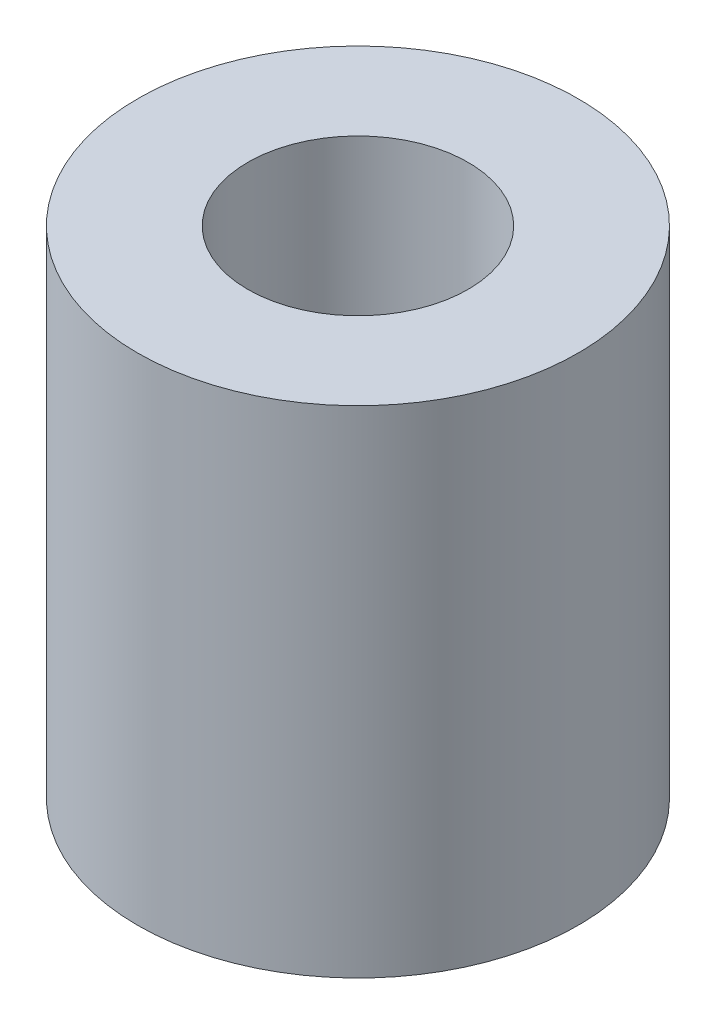
ISO-10303-21;
HEADER;
FILE_DESCRIPTION(('STEP AP214'),'2;1');
FILE_NAME('part.step','',(''),(''),'','','');
FILE_SCHEMA(('AUTOMOTIVE_DESIGN { 1 0 10303 214 1 1 1 1 }'));
ENDSEC;
DATA;
#1=APPLICATION_CONTEXT('core data for automotive mechanical design processes');
#2=APPLICATION_PROTOCOL_DEFINITION('international standard','automotive_design',2000,#1);
#3=PRODUCT_CONTEXT('',#1,'mechanical');
#4=PRODUCT('Part','Part','',(#3));
#5=PRODUCT_RELATED_PRODUCT_CATEGORY('part','',(#4));
#6=PRODUCT_DEFINITION_FORMATION('','',#4);
#7=PRODUCT_DEFINITION_CONTEXT('part definition',#1,'design');
#8=PRODUCT_DEFINITION('design','',#6,#7);
#9=PRODUCT_DEFINITION_SHAPE('','',#8);
#10=(LENGTH_UNIT() NAMED_UNIT(*) SI_UNIT(.MILLI.,.METRE.));
#11=(NAMED_UNIT(*) PLANE_ANGLE_UNIT() SI_UNIT($,.RADIAN.));
#12=(NAMED_UNIT(*) SI_UNIT($,.STERADIAN.) SOLID_ANGLE_UNIT());
#13=UNCERTAINTY_MEASURE_WITH_UNIT(LENGTH_MEASURE(1.E-05),#10,'distance_accuracy_value','');
#14=(GEOMETRIC_REPRESENTATION_CONTEXT(3) GLOBAL_UNCERTAINTY_ASSIGNED_CONTEXT((#13)) GLOBAL_UNIT_ASSIGNED_CONTEXT((#10,
#11,#12)) REPRESENTATION_CONTEXT('',''));
#15=CARTESIAN_POINT('',(0.,0.,0.));
#16=DIRECTION('',(0.,0.,1.));
#17=DIRECTION('',(1.,0.,0.));
#18=AXIS2_PLACEMENT_3D('',#15,#16,#17);
#19=CARTESIAN_POINT('',(0.,13.5,0.));
#20=DIRECTION('',(0.,1.,0.));
#21=DIRECTION('',(0.,0.,1.));
#22=AXIS2_PLACEMENT_3D('',#19,#20,#21);
#23=PLANE('',#22);
#24=CARTESIAN_POINT('',(0.,13.5,0.));
#25=DIRECTION('',(0.,1.,0.));
#26=DIRECTION('',(0.,0.,1.));
#27=AXIS2_PLACEMENT_3D('',#24,#25,#26);
#28=CIRCLE('',#27,6.);
#29=CARTESIAN_POINT('',(0.,13.5,6.));
#30=VERTEX_POINT('',#29);
#31=EDGE_CURVE('E11',#30,#30,#28,.T.);
#32=ORIENTED_EDGE('',*,*,#31,.T.);
#33=EDGE_LOOP('',(#32));
#34=FACE_BOUND('',#33,.T.);
#35=CARTESIAN_POINT('',(0.,13.5,0.));
#36=DIRECTION('',(0.,1.,0.));
#37=DIRECTION('',(0.,0.,1.));
#38=AXIS2_PLACEMENT_3D('',#35,#36,#37);
#39=CIRCLE('',#38,3.);
#40=CARTESIAN_POINT('',(0.,13.5,3.));
#41=VERTEX_POINT('',#40);
#42=EDGE_CURVE('E47',#41,#41,#39,.T.);
#43=ORIENTED_EDGE('',*,*,#42,.F.);
#44=EDGE_LOOP('',(#43));
#45=FACE_BOUND('',#44,.T.);
#46=ADVANCED_FACE('F36',(#34,#45),#23,.T.);
#47=CARTESIAN_POINT('',(0.,0.,0.));
#48=DIRECTION('',(0.,1.,0.));
#49=DIRECTION('',(0.,0.,1.));
#50=AXIS2_PLACEMENT_3D('',#47,#48,#49);
#51=PLANE('',#50);
#52=CARTESIAN_POINT('',(0.,0.,0.));
#53=DIRECTION('',(0.,1.,0.));
#54=DIRECTION('',(0.,0.,1.));
#55=AXIS2_PLACEMENT_3D('',#52,#53,#54);
#56=CIRCLE('',#55,6.);
#57=CARTESIAN_POINT('',(0.,0.,6.));
#58=VERTEX_POINT('',#57);
#59=EDGE_CURVE('E40',#58,#58,#56,.T.);
#60=ORIENTED_EDGE('',*,*,#59,.F.);
#61=EDGE_LOOP('',(#60));
#62=FACE_BOUND('',#61,.T.);
#63=CARTESIAN_POINT('',(0.,0.,0.));
#64=DIRECTION('',(0.,1.,0.));
#65=DIRECTION('',(0.,0.,1.));
#66=AXIS2_PLACEMENT_3D('',#63,#64,#65);
#67=CIRCLE('',#66,3.);
#68=CARTESIAN_POINT('',(0.,0.,3.));
#69=VERTEX_POINT('',#68);
#70=EDGE_CURVE('E49',#69,#69,#67,.T.);
#71=ORIENTED_EDGE('',*,*,#70,.T.);
#72=EDGE_LOOP('',(#71));
#73=FACE_BOUND('',#72,.T.);
#74=ADVANCED_FACE('F59',(#62,#73),#51,.F.);
#75=CARTESIAN_POINT('',(0.,13.5,0.));
#76=DIRECTION('',(0.,-1.,0.));
#77=DIRECTION('',(0.,0.,-1.));
#78=AXIS2_PLACEMENT_3D('',#75,#76,#77);
#79=CYLINDRICAL_SURFACE('',#78,6.);
#80=ORIENTED_EDGE('',*,*,#31,.F.);
#81=EDGE_LOOP('',(#80));
#82=FACE_BOUND('',#81,.T.);
#83=ORIENTED_EDGE('',*,*,#59,.T.);
#84=EDGE_LOOP('',(#83));
#85=FACE_BOUND('',#84,.T.);
#86=ADVANCED_FACE('F38',(#82,#85),#79,.T.);
#87=CARTESIAN_POINT('',(0.,13.5,0.));
#88=DIRECTION('',(0.,-1.,0.));
#89=DIRECTION('',(0.,0.,-1.));
#90=AXIS2_PLACEMENT_3D('',#87,#88,#89);
#91=CYLINDRICAL_SURFACE('',#90,3.);
#92=ORIENTED_EDGE('',*,*,#42,.T.);
#93=EDGE_LOOP('',(#92));
#94=FACE_BOUND('',#93,.T.);
#95=ORIENTED_EDGE('',*,*,#70,.F.);
#96=EDGE_LOOP('',(#95));
#97=FACE_BOUND('',#96,.T.);
#98=ADVANCED_FACE('F55',(#94,#97),#91,.F.);
#99=CLOSED_SHELL('',(#46,#74,#86,#98));
#100=MANIFOLD_SOLID_BREP('B2',#99);
#101=ADVANCED_BREP_SHAPE_REPRESENTATION('',(#18,#100),#14);
#102=SHAPE_DEFINITION_REPRESENTATION(#9,#101);
ENDSEC;
END-ISO-10303-21;
